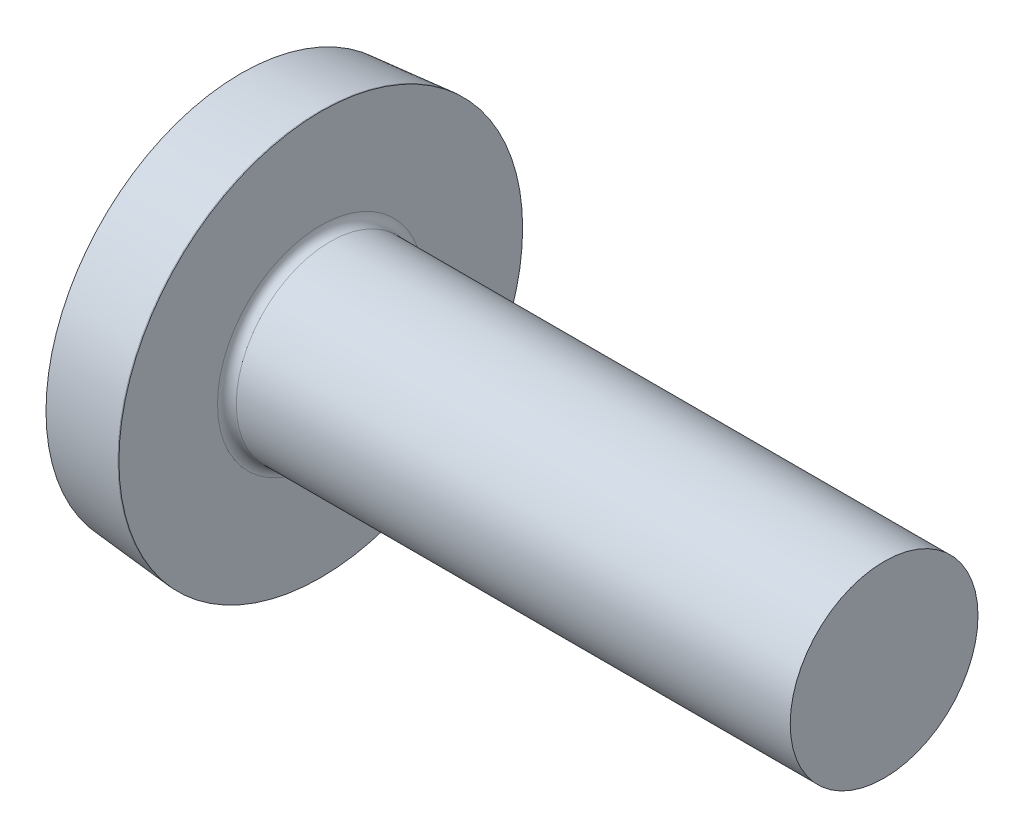
ISO-10303-21;
HEADER;
FILE_DESCRIPTION(('STEP AP214'),'2;1');
FILE_NAME('part.step','',(''),(''),'','','');
FILE_SCHEMA(('AUTOMOTIVE_DESIGN { 1 0 10303 214 1 1 1 1 }'));
ENDSEC;
DATA;
#1=APPLICATION_CONTEXT('core data for automotive mechanical design processes');
#2=APPLICATION_PROTOCOL_DEFINITION('international standard','automotive_design',2000,#1);
#3=PRODUCT_CONTEXT('',#1,'mechanical');
#4=PRODUCT('Part','Part','',(#3));
#5=PRODUCT_RELATED_PRODUCT_CATEGORY('part','',(#4));
#6=PRODUCT_DEFINITION_FORMATION('','',#4);
#7=PRODUCT_DEFINITION_CONTEXT('part definition',#1,'design');
#8=PRODUCT_DEFINITION('design','',#6,#7);
#9=PRODUCT_DEFINITION_SHAPE('','',#8);
#10=(LENGTH_UNIT() NAMED_UNIT(*) SI_UNIT(.MILLI.,.METRE.));
#11=(NAMED_UNIT(*) PLANE_ANGLE_UNIT() SI_UNIT($,.RADIAN.));
#12=(NAMED_UNIT(*) SI_UNIT($,.STERADIAN.) SOLID_ANGLE_UNIT());
#13=UNCERTAINTY_MEASURE_WITH_UNIT(LENGTH_MEASURE(1.E-05),#10,'distance_accuracy_value','');
#14=(GEOMETRIC_REPRESENTATION_CONTEXT(3) GLOBAL_UNCERTAINTY_ASSIGNED_CONTEXT((#13)) GLOBAL_UNIT_ASSIGNED_CONTEXT((#10,
#11,#12)) REPRESENTATION_CONTEXT('',''));
#15=CARTESIAN_POINT('',(0.,0.,0.));
#16=DIRECTION('',(0.,0.,1.));
#17=DIRECTION('',(1.,0.,0.));
#18=AXIS2_PLACEMENT_3D('',#15,#16,#17);
#19=CARTESIAN_POINT('',(6.3348454251532,0.,0.));
#20=DIRECTION('',(-1.,0.,0.));
#21=DIRECTION('',(0.,1.,0.));
#22=AXIS2_PLACEMENT_3D('',#19,#20,#21);
#23=SPHERICAL_SURFACE('',#22,6.3348454251532);
#24=CARTESIAN_POINT('',(0.35,0.,0.));
#25=DIRECTION('',(-1.,0.,0.));
#26=DIRECTION('',(0.,0.,1.));
#27=AXIS2_PLACEMENT_3D('',#24,#25,#26);
#28=CIRCLE('',#27,2.07650952263822);
#29=CARTESIAN_POINT('',(0.35,0.,2.07650952263822));
#30=VERTEX_POINT('',#29);
#31=EDGE_CURVE('E213',#30,#30,#28,.T.);
#32=ORIENTED_EDGE('',*,*,#31,.T.);
#33=EDGE_LOOP('',(#32));
#34=FACE_BOUND('',#33,.T.);
#35=CARTESIAN_POINT('',(0.0308541818001143,0.,0.));
#36=DIRECTION('',(1.,0.,0.));
#37=DIRECTION('',(0.,0.,-1.));
#38=AXIS2_PLACEMENT_3D('',#35,#36,#37);
#39=CIRCLE('',#38,0.624468545494531);
#40=CARTESIAN_POINT('',(0.0308541818001147,-0.369999999999998,-0.503051651733752));
#41=VERTEX_POINT('',#40);
#42=CARTESIAN_POINT('',(0.0308541818001148,-0.503051651733748,-0.37));
#43=VERTEX_POINT('',#42);
#44=EDGE_CURVE('E339',#41,#43,#39,.F.);
#45=ORIENTED_EDGE('',*,*,#44,.F.);
#46=CARTESIAN_POINT('',(6.3348454251532,-0.370000000000002,0.));
#47=DIRECTION('',(0.,1.,0.));
#48=DIRECTION('',(0.,0.,1.));
#49=AXIS2_PLACEMENT_3D('',#46,#47,#48);
#50=CIRCLE('',#49,6.32403087916121);
#51=CARTESIAN_POINT('',(0.0987223988869555,-0.369999999999996,-1.05077883584338));
#52=VERTEX_POINT('',#51);
#53=EDGE_CURVE('E273',#52,#41,#50,.T.);
#54=ORIENTED_EDGE('',*,*,#53,.F.);
#55=CARTESIAN_POINT('',(5.51287510984501,0.,1.64861767760881));
#56=DIRECTION('',(0.446197753347436,0.,-0.894934391398443));
#57=DIRECTION('',(-0.894934391398442,0.,-0.446197753347436));
#58=AXIS2_PLACEMENT_3D('',#55,#56,#57);
#59=CIRCLE('',#58,6.06108002870877);
#60=CARTESIAN_POINT('',(0.0987223988869555,0.370000000000004,-1.05077883584338));
#61=VERTEX_POINT('',#60);
#62=EDGE_CURVE('E247',#52,#61,#59,.T.);
#63=ORIENTED_EDGE('',*,*,#62,.T.);
#64=CARTESIAN_POINT('',(6.3348454251532,0.37,0.));
#65=DIRECTION('',(0.,-1.,0.));
#66=DIRECTION('',(0.,0.,-1.));
#67=AXIS2_PLACEMENT_3D('',#64,#65,#66);
#68=CIRCLE('',#67,6.32403087916121);
#69=CARTESIAN_POINT('',(0.0308541818001145,0.370000000000002,-0.503051651733749));
#70=VERTEX_POINT('',#69);
#71=EDGE_CURVE('E301',#70,#61,#68,.T.);
#72=ORIENTED_EDGE('',*,*,#71,.F.);
#73=CARTESIAN_POINT('',(0.0308541818001148,0.50305165173374,-0.37));
#74=VERTEX_POINT('',#73);
#75=EDGE_CURVE('E354',#74,#70,#39,.F.);
#76=ORIENTED_EDGE('',*,*,#75,.F.);
#77=CARTESIAN_POINT('',(6.3348454251532,0.,-0.37));
#78=DIRECTION('',(0.,0.,1.));
#79=DIRECTION('',(0.,-1.,0.));
#80=AXIS2_PLACEMENT_3D('',#77,#78,#79);
#81=CIRCLE('',#80,6.32403087916121);
#82=CARTESIAN_POINT('',(0.0987223988869555,1.05077883584338,-0.37));
#83=VERTEX_POINT('',#82);
#84=EDGE_CURVE('E241',#83,#74,#81,.T.);
#85=ORIENTED_EDGE('',*,*,#84,.F.);
#86=CARTESIAN_POINT('',(5.51287510984501,-1.64861767760882,0.));
#87=DIRECTION('',(0.446197753347436,0.894934391398442,0.));
#88=DIRECTION('',(-0.894934391398442,0.446197753347436,0.));
#89=AXIS2_PLACEMENT_3D('',#86,#87,#88);
#90=CIRCLE('',#89,6.06108002870877);
#91=CARTESIAN_POINT('',(0.0987223988869555,1.05077883584338,0.37));
#92=VERTEX_POINT('',#91);
#93=EDGE_CURVE('E244',#83,#92,#90,.T.);
#94=ORIENTED_EDGE('',*,*,#93,.T.);
#95=CARTESIAN_POINT('',(6.3348454251532,0.,0.370000000000002));
#96=DIRECTION('',(0.,0.,-1.));
#97=DIRECTION('',(-1.,0.,0.));
#98=AXIS2_PLACEMENT_3D('',#95,#96,#97);
#99=CIRCLE('',#98,6.32403087916121);
#100=CARTESIAN_POINT('',(0.0308541818001143,0.503051651733743,0.369999999999999));
#101=VERTEX_POINT('',#100);
#102=EDGE_CURVE('E237',#101,#92,#99,.T.);
#103=ORIENTED_EDGE('',*,*,#102,.F.);
#104=CARTESIAN_POINT('',(0.0308541818001154,0.369999999999998,0.503051651733752));
#105=VERTEX_POINT('',#104);
#106=EDGE_CURVE('E353',#105,#101,#39,.F.);
#107=ORIENTED_EDGE('',*,*,#106,.F.);
#108=CARTESIAN_POINT('',(0.0987223988869546,0.369999999999996,1.05077883584338));
#109=VERTEX_POINT('',#108);
#110=EDGE_CURVE('E257',#109,#105,#68,.T.);
#111=ORIENTED_EDGE('',*,*,#110,.F.);
#112=CARTESIAN_POINT('',(5.51287510984501,0.,-1.64861767760882));
#113=DIRECTION('',(0.446197753347436,0.,0.894934391398442));
#114=DIRECTION('',(0.894934391398442,0.,-0.446197753347436));
#115=AXIS2_PLACEMENT_3D('',#112,#113,#114);
#116=CIRCLE('',#115,6.06108002870877);
#117=CARTESIAN_POINT('',(0.0987223988869546,-0.370000000000004,1.05077883584338));
#118=VERTEX_POINT('',#117);
#119=EDGE_CURVE('E48',#109,#118,#116,.T.);
#120=ORIENTED_EDGE('',*,*,#119,.T.);
#121=CARTESIAN_POINT('',(0.0308541818001156,-0.370000000000001,0.50305165173375));
#122=VERTEX_POINT('',#121);
#123=EDGE_CURVE('E254',#122,#118,#50,.T.);
#124=ORIENTED_EDGE('',*,*,#123,.F.);
#125=CARTESIAN_POINT('',(0.0308541818001143,-0.503051651733752,0.369999999999999));
#126=VERTEX_POINT('',#125);
#127=EDGE_CURVE('E385',#126,#122,#39,.F.);
#128=ORIENTED_EDGE('',*,*,#127,.F.);
#129=CARTESIAN_POINT('',(0.0987223988869555,-1.05077883584338,0.369999999999999));
#130=VERTEX_POINT('',#129);
#131=EDGE_CURVE('E238',#130,#126,#99,.T.);
#132=ORIENTED_EDGE('',*,*,#131,.F.);
#133=CARTESIAN_POINT('',(5.51287510984501,1.64861767760881,0.));
#134=DIRECTION('',(0.446197753347436,-0.894934391398443,0.));
#135=DIRECTION('',(0.894934391398442,0.446197753347436,0.));
#136=AXIS2_PLACEMENT_3D('',#133,#134,#135);
#137=CIRCLE('',#136,6.06108002870877);
#138=CARTESIAN_POINT('',(0.0987223988869555,-1.05077883584338,-0.37));
#139=VERTEX_POINT('',#138);
#140=EDGE_CURVE('E234',#130,#139,#137,.T.);
#141=ORIENTED_EDGE('',*,*,#140,.T.);
#142=EDGE_CURVE('E63',#43,#139,#81,.T.);
#143=ORIENTED_EDGE('',*,*,#142,.F.);
#144=EDGE_LOOP('',(#45,#54,#63,#72,#76,#85,#94,#103,#107,#111,#120,#124,#128,#132,#141,#143));
#145=FACE_BOUND('',#144,.T.);
#146=ADVANCED_FACE('F35',(#34,#145),#23,.T.);
#147=CARTESIAN_POINT('',(1.01,0.596432660078354,-0.37));
#148=DIRECTION('',(0.,0.,1.));
#149=DIRECTION('',(0.,-1.,0.));
#150=AXIS2_PLACEMENT_3D('',#147,#148,#149);
#151=PLANE('',#150);
#152=ORIENTED_EDGE('',*,*,#84,.T.);
#153=CARTESIAN_POINT('',(-1.00375424089343,0.59046737533365,-0.37));
#154=CARTESIAN_POINT('',(-0.812310935860284,0.574661113876544,-0.37));
#155=CARTESIAN_POINT('',(-0.620880739529457,0.558692671237369,-0.37));
#156=CARTESIAN_POINT('',(-0.238044908616173,0.526292999478973,-0.37));
#157=CARTESIAN_POINT('',(-0.0466392770084405,0.50986173526022,-0.37));
#158=CARTESIAN_POINT('',(0.336119298740636,0.476400416240064,-0.37));
#159=CARTESIAN_POINT('',(0.52747224306179,0.459370363508376,-0.37));
#160=CARTESIAN_POINT('',(0.814438066922587,0.433198294596456,-0.37));
#161=CARTESIAN_POINT('',(0.910079559074602,0.424370077730999,-0.37));
#162=CARTESIAN_POINT('',(1.10134094999858,0.406460000314888,-0.37));
#163=CARTESIAN_POINT('',(1.19696084824844,0.397378134180927,-0.37));
#164=CARTESIAN_POINT('',(1.45340398862988,0.372604820081678,-0.37));
#165=CARTESIAN_POINT('',(1.61420013682287,0.356631661992527,-0.37));
#166=CARTESIAN_POINT('',(1.93565257091465,0.323419643215244,-0.37));
#167=CARTESIAN_POINT('',(2.09630886589015,0.306180872007446,-0.37));
#168=CARTESIAN_POINT('',(2.33714482323072,0.278751725007018,-0.37));
#169=CARTESIAN_POINT('',(2.41741328301872,0.269344994364363,-0.37));
#170=CARTESIAN_POINT('',(2.57785878610541,0.249811311041056,-0.37));
#171=CARTESIAN_POINT('',(2.65803583391149,0.239684395583776,-0.37));
#172=CARTESIAN_POINT('',(2.8182787310521,0.218399805516524,-0.37));
#173=CARTESIAN_POINT('',(2.89834454264389,0.207241840980378,-0.37));
#174=CARTESIAN_POINT('',(3.01826768351679,0.189275113325608,-0.37));
#175=CARTESIAN_POINT('',(3.05821623214618,0.183080654485872,-0.37));
#176=CARTESIAN_POINT('',(3.13802273653468,0.17011763897259,-0.37));
#177=CARTESIAN_POINT('',(3.17788068529328,0.16334903938742,-0.37));
#178=CARTESIAN_POINT('',(3.21767546600845,0.156211627647228,-0.37));
#179=B_SPLINE_CURVE_WITH_KNOTS('',3,(#153,#154,#155,#156,#157,#158,#159,#160,#161,#162,#163,
#164,#165,#166,#167,#168,#169,#170,#171,#172,#173,#174,#175,#176,#177,#178),.UNSPECIFIED.,.F.,
.F.,(4,2,2,2,2,2,2,2,2,2,2,2,4),(0.,0.576284452128467,1.15261272690249,1.72893900979114,
2.01708296211952,2.3052332620563,2.78999332133071,3.27471914044355,3.51717007338411,
3.75960848413396,4.00211527609772,4.123389551722,4.24467289945864),.UNSPECIFIED.);
#180=CARTESIAN_POINT('',(1.01,0.415013252800438,-0.369999999999999));
#181=VERTEX_POINT('',#180);
#182=EDGE_CURVE('E374',#74,#181,#179,.T.);
#183=ORIENTED_EDGE('',*,*,#182,.T.);
#184=DIRECTION('',(0.,1.,0.));
#185=VECTOR('',#184,1.);
#186=CARTESIAN_POINT('',(1.01,-0.596432660078355,-0.37));
#187=LINE('',#186,#185);
#188=CARTESIAN_POINT('',(1.01,0.596432660078354,-0.37));
#189=VERTEX_POINT('',#188);
#190=EDGE_CURVE('E322',#181,#189,#187,.T.);
#191=ORIENTED_EDGE('',*,*,#190,.T.);
#192=DIRECTION('',(0.894934391398442,-0.446197753347436,0.));
#193=VECTOR('',#192,1.);
#194=CARTESIAN_POINT('',(0.,1.1,-0.37));
#195=LINE('',#194,#193);
#196=EDGE_CURVE('E214',#83,#189,#195,.T.);
#197=ORIENTED_EDGE('',*,*,#196,.F.);
#198=EDGE_LOOP('',(#152,#183,#191,#197));
#199=FACE_BOUND('',#198,.T.);
#200=ADVANCED_FACE('F169',(#199),#151,.T.);
#201=CARTESIAN_POINT('',(1.01,-0.596432660078355,-0.37));
#202=VERTEX_POINT('',#201);
#203=CARTESIAN_POINT('',(1.01,-0.415013252800438,-0.369999999999999));
#204=VERTEX_POINT('',#203);
#205=EDGE_CURVE('E222',#202,#204,#187,.T.);
#206=ORIENTED_EDGE('',*,*,#205,.T.);
#207=CARTESIAN_POINT('',(-1.00375424089343,-0.59046737533365,-0.37));
#208=CARTESIAN_POINT('',(-0.812310935860285,-0.574661113876544,-0.37));
#209=CARTESIAN_POINT('',(-0.620880739529458,-0.558692671237369,-0.37));
#210=CARTESIAN_POINT('',(-0.238044908616174,-0.526292999478973,-0.37));
#211=CARTESIAN_POINT('',(-0.0466392770084411,-0.50986173526022,-0.37));
#212=CARTESIAN_POINT('',(0.336119298740635,-0.476400416240064,-0.37));
#213=CARTESIAN_POINT('',(0.527472243061789,-0.459370363508376,-0.37));
#214=CARTESIAN_POINT('',(0.814438066922586,-0.433198294596456,-0.37));
#215=CARTESIAN_POINT('',(0.910079559074601,-0.424370077730999,-0.37));
#216=CARTESIAN_POINT('',(1.10134094999858,-0.406460000314888,-0.37));
#217=CARTESIAN_POINT('',(1.19696084824844,-0.397378134180927,-0.37));
#218=CARTESIAN_POINT('',(1.45340398862988,-0.372604820081678,-0.37));
#219=CARTESIAN_POINT('',(1.61420013682287,-0.356631661992527,-0.37));
#220=CARTESIAN_POINT('',(1.93565257091465,-0.323419643215243,-0.37));
#221=CARTESIAN_POINT('',(2.09630886589015,-0.306180872007446,-0.37));
#222=CARTESIAN_POINT('',(2.33714482323072,-0.278751725007017,-0.37));
#223=CARTESIAN_POINT('',(2.41741328301872,-0.269344994364363,-0.37));
#224=CARTESIAN_POINT('',(2.57785878610541,-0.249811311041056,-0.37));
#225=CARTESIAN_POINT('',(2.6580358339115,-0.239684395583775,-0.37));
#226=CARTESIAN_POINT('',(2.81827873105211,-0.218399805516523,-0.37));
#227=CARTESIAN_POINT('',(2.8983445426439,-0.207241840980377,-0.37));
#228=CARTESIAN_POINT('',(3.01826768351679,-0.189275113325608,-0.37));
#229=CARTESIAN_POINT('',(3.05821623214619,-0.183080654485871,-0.37));
#230=CARTESIAN_POINT('',(3.13802273653468,-0.170117638972589,-0.37));
#231=CARTESIAN_POINT('',(3.17788068529328,-0.16334903938742,-0.37));
#232=CARTESIAN_POINT('',(3.21767546600845,-0.156211627647227,-0.37));
#233=B_SPLINE_CURVE_WITH_KNOTS('',3,(#207,#208,#209,#210,#211,#212,#213,#214,#215,#216,#217,
#218,#219,#220,#221,#222,#223,#224,#225,#226,#227,#228,#229,#230,#231,#232),.UNSPECIFIED.,.F.,
.F.,(4,2,2,2,2,2,2,2,2,2,2,2,4),(0.,0.576284452128467,1.15261272690249,1.72893900979114,
2.01708296211952,2.3052332620563,2.78999332133071,3.27471914044355,3.51717007338411,
3.75960848413396,4.00211527609772,4.123389551722,4.24467289945864),.UNSPECIFIED.);
#234=EDGE_CURVE('E352',#204,#43,#233,.F.);
#235=ORIENTED_EDGE('',*,*,#234,.T.);
#236=ORIENTED_EDGE('',*,*,#142,.T.);
#237=DIRECTION('',(0.894934391398442,0.446197753347436,0.));
#238=VECTOR('',#237,1.);
#239=CARTESIAN_POINT('',(0.,-1.1,-0.37));
#240=LINE('',#239,#238);
#241=EDGE_CURVE('E304',#139,#202,#240,.T.);
#242=ORIENTED_EDGE('',*,*,#241,.T.);
#243=EDGE_LOOP('',(#206,#235,#236,#242));
#244=FACE_BOUND('',#243,.T.);
#245=ADVANCED_FACE('F175',(#244),#151,.T.);
#246=CARTESIAN_POINT('',(1.01,-0.596432660078355,0.37));
#247=DIRECTION('',(0.,0.,-1.));
#248=DIRECTION('',(-1.,0.,0.));
#249=AXIS2_PLACEMENT_3D('',#246,#247,#248);
#250=PLANE('',#249);
#251=DIRECTION('',(0.,-1.,0.));
#252=VECTOR('',#251,1.);
#253=CARTESIAN_POINT('',(1.01,0.596432660078354,0.37));
#254=LINE('',#253,#252);
#255=CARTESIAN_POINT('',(1.01,0.596432660078354,0.37));
#256=VERTEX_POINT('',#255);
#257=CARTESIAN_POINT('',(1.01,0.415013252800438,0.369999999999999));
#258=VERTEX_POINT('',#257);
#259=EDGE_CURVE('E312',#256,#258,#254,.T.);
#260=ORIENTED_EDGE('',*,*,#259,.T.);
#261=CARTESIAN_POINT('',(-1.00375424089236,0.590467375333562,0.369999999999999));
#262=CARTESIAN_POINT('',(-0.81231093585923,0.574661113876457,0.369999999999999));
#263=CARTESIAN_POINT('',(-0.620880739528422,0.558692671237283,0.369999999999999));
#264=CARTESIAN_POINT('',(-0.238044908615175,0.526292999478888,0.369999999999999));
#265=CARTESIAN_POINT('',(-0.0466392770074608,0.509861735260135,0.37));
#266=CARTESIAN_POINT('',(0.336119298741582,0.47640041623998,0.37));
#267=CARTESIAN_POINT('',(0.527472243062721,0.459370363508292,0.37));
#268=CARTESIAN_POINT('',(0.814438066923495,0.433198294596373,0.37));
#269=CARTESIAN_POINT('',(0.910079559075503,0.424370077730915,0.37));
#270=CARTESIAN_POINT('',(1.10134094999946,0.406460000314804,0.37));
#271=CARTESIAN_POINT('',(1.19696084824931,0.397378134180843,0.37));
#272=CARTESIAN_POINT('',(1.45340398863075,0.372604820081592,0.37));
#273=CARTESIAN_POINT('',(1.61420013682374,0.356631661992439,0.37));
#274=CARTESIAN_POINT('',(1.93565257091552,0.323419643215151,0.37));
#275=CARTESIAN_POINT('',(2.09630886589102,0.306180872007351,0.37));
#276=CARTESIAN_POINT('',(2.33714482323159,0.278751725006916,0.37));
#277=CARTESIAN_POINT('',(2.41741328301959,0.269344994364259,0.37));
#278=CARTESIAN_POINT('',(2.57785878610628,0.249811311040946,0.37));
#279=CARTESIAN_POINT('',(2.65803583391236,0.239684395583663,0.370000000000001));
#280=CARTESIAN_POINT('',(2.81827873105297,0.218399805516403,0.370000000000001));
#281=CARTESIAN_POINT('',(2.89834454264476,0.207241840980253,0.370000000000001));
#282=CARTESIAN_POINT('',(3.01826768351766,0.189275113325474,0.370000000000001));
#283=CARTESIAN_POINT('',(3.05821623214705,0.183080654485734,0.370000000000001));
#284=CARTESIAN_POINT('',(3.13802273653554,0.170117638972443,0.370000000000001));
#285=CARTESIAN_POINT('',(3.17788068529415,0.163349039387269,0.370000000000001));
#286=CARTESIAN_POINT('',(3.21767546600931,0.15621162764707,0.370000000000001));
#287=B_SPLINE_CURVE_WITH_KNOTS('',3,(#261,#262,#263,#264,#265,#266,#267,#268,#269,#270,#271,
#272,#273,#274,#275,#276,#277,#278,#279,#280,#281,#282,#283,#284,#285,#286),.UNSPECIFIED.,.F.,
.F.,(4,2,2,2,2,2,2,2,2,2,2,2,4),(0.,0.576284452128412,1.15261272690238,1.72893900979099,
2.01708296211935,2.3052332620561,2.78999332133051,3.27471914044335,3.51717007338391,
3.75960848413376,4.00211527609752,4.1233895517218,4.24467289945844),.UNSPECIFIED.);
#288=EDGE_CURVE('E278',#258,#101,#287,.F.);
#289=ORIENTED_EDGE('',*,*,#288,.T.);
#290=ORIENTED_EDGE('',*,*,#102,.T.);
#291=DIRECTION('',(0.894934391398442,-0.446197753347436,0.));
#292=VECTOR('',#291,1.);
#293=CARTESIAN_POINT('',(0.,1.1,0.37));
#294=LINE('',#293,#292);
#295=EDGE_CURVE('E219',#92,#256,#294,.T.);
#296=ORIENTED_EDGE('',*,*,#295,.T.);
#297=EDGE_LOOP('',(#260,#289,#290,#296));
#298=FACE_BOUND('',#297,.T.);
#299=ADVANCED_FACE('F370',(#298),#250,.T.);
#300=ORIENTED_EDGE('',*,*,#131,.T.);
#301=CARTESIAN_POINT('',(-1.00375424089236,-0.590467375333562,0.369999999999999));
#302=CARTESIAN_POINT('',(-0.81231093585923,-0.574661113876457,0.369999999999999));
#303=CARTESIAN_POINT('',(-0.620880739528422,-0.558692671237283,0.369999999999999));
#304=CARTESIAN_POINT('',(-0.238044908615175,-0.526292999478888,0.369999999999999));
#305=CARTESIAN_POINT('',(-0.0466392770074607,-0.509861735260136,0.369999999999999));
#306=CARTESIAN_POINT('',(0.336119298741582,-0.47640041623998,0.37));
#307=CARTESIAN_POINT('',(0.52747224306272,-0.459370363508292,0.37));
#308=CARTESIAN_POINT('',(0.814438066923495,-0.433198294596373,0.37));
#309=CARTESIAN_POINT('',(0.910079559075503,-0.424370077730915,0.37));
#310=CARTESIAN_POINT('',(1.10134094999946,-0.406460000314804,0.37));
#311=CARTESIAN_POINT('',(1.19696084824931,-0.397378134180843,0.37));
#312=CARTESIAN_POINT('',(1.45340398863075,-0.372604820081592,0.37));
#313=CARTESIAN_POINT('',(1.61420013682374,-0.356631661992439,0.37));
#314=CARTESIAN_POINT('',(1.93565257091552,-0.323419643215151,0.37));
#315=CARTESIAN_POINT('',(2.09630886589102,-0.306180872007351,0.37));
#316=CARTESIAN_POINT('',(2.33714482323159,-0.278751725006916,0.37));
#317=CARTESIAN_POINT('',(2.41741328301959,-0.269344994364259,0.37));
#318=CARTESIAN_POINT('',(2.57785878610628,-0.249811311040947,0.37));
#319=CARTESIAN_POINT('',(2.65803583391236,-0.239684395583663,0.370000000000001));
#320=CARTESIAN_POINT('',(2.81827873105297,-0.218399805516403,0.370000000000001));
#321=CARTESIAN_POINT('',(2.89834454264476,-0.207241840980253,0.370000000000001));
#322=CARTESIAN_POINT('',(3.01826768351765,-0.189275113325474,0.370000000000001));
#323=CARTESIAN_POINT('',(3.05821623214705,-0.183080654485734,0.370000000000001));
#324=CARTESIAN_POINT('',(3.13802273653554,-0.170117638972444,0.370000000000001));
#325=CARTESIAN_POINT('',(3.17788068529414,-0.163349039387269,0.370000000000001));
#326=CARTESIAN_POINT('',(3.21767546600931,-0.15621162764707,0.370000000000001));
#327=B_SPLINE_CURVE_WITH_KNOTS('',3,(#301,#302,#303,#304,#305,#306,#307,#308,#309,#310,#311,
#312,#313,#314,#315,#316,#317,#318,#319,#320,#321,#322,#323,#324,#325,#326),.UNSPECIFIED.,.F.,
.F.,(4,2,2,2,2,2,2,2,2,2,2,2,4),(0.,0.576284452128412,1.15261272690238,1.72893900979099,
2.01708296211935,2.3052332620561,2.78999332133051,3.27471914044335,3.51717007338391,
3.75960848413376,4.00211527609752,4.1233895517218,4.24467289945844),.UNSPECIFIED.);
#328=CARTESIAN_POINT('',(1.01,-0.415013252800438,0.369999999999999));
#329=VERTEX_POINT('',#328);
#330=EDGE_CURVE('E386',#126,#329,#327,.T.);
#331=ORIENTED_EDGE('',*,*,#330,.T.);
#332=CARTESIAN_POINT('',(1.01,-0.596432660078355,0.37));
#333=VERTEX_POINT('',#332);
#334=EDGE_CURVE('E314',#329,#333,#254,.T.);
#335=ORIENTED_EDGE('',*,*,#334,.T.);
#336=DIRECTION('',(0.894934391398442,0.446197753347436,0.));
#337=VECTOR('',#336,1.);
#338=CARTESIAN_POINT('',(0.,-1.1,0.369999999999999));
#339=LINE('',#338,#337);
#340=EDGE_CURVE('E306',#130,#333,#339,.T.);
#341=ORIENTED_EDGE('',*,*,#340,.F.);
#342=EDGE_LOOP('',(#300,#331,#335,#341));
#343=FACE_BOUND('',#342,.T.);
#344=ADVANCED_FACE('F415',(#343),#250,.T.);
#345=CARTESIAN_POINT('',(1.01,0.596432660078354,-0.37));
#346=DIRECTION('',(-1.,0.,0.));
#347=DIRECTION('',(0.,0.,1.));
#348=AXIS2_PLACEMENT_3D('',#345,#346,#347);
#349=PLANE('',#348);
#350=ORIENTED_EDGE('',*,*,#334,.F.);
#351=CARTESIAN_POINT('',(1.01,0.,0.));
#352=DIRECTION('',(-1.,0.,0.));
#353=DIRECTION('',(0.,0.,1.));
#354=AXIS2_PLACEMENT_3D('',#351,#352,#353);
#355=CIRCLE('',#354,0.556);
#356=EDGE_CURVE('E347',#204,#329,#355,.T.);
#357=ORIENTED_EDGE('',*,*,#356,.F.);
#358=ORIENTED_EDGE('',*,*,#205,.F.);
#359=DIRECTION('',(0.,0.,1.));
#360=VECTOR('',#359,1.);
#361=CARTESIAN_POINT('',(1.01,-0.596432660078355,-0.37));
#362=LINE('',#361,#360);
#363=EDGE_CURVE('E309',#202,#333,#362,.T.);
#364=ORIENTED_EDGE('',*,*,#363,.T.);
#365=EDGE_LOOP('',(#350,#357,#358,#364));
#366=FACE_BOUND('',#365,.T.);
#367=ADVANCED_FACE('F408',(#366),#349,.T.);
#368=DIRECTION('',(0.,0.,-1.));
#369=VECTOR('',#368,1.);
#370=CARTESIAN_POINT('',(1.01,-0.370000000000002,0.596432660078353));
#371=LINE('',#370,#369);
#372=CARTESIAN_POINT('',(1.01,-0.369999999999998,-0.415013252800441));
#373=VERTEX_POINT('',#372);
#374=CARTESIAN_POINT('',(1.01,-0.369999999999998,-0.596432660078356));
#375=VERTEX_POINT('',#374);
#376=EDGE_CURVE('E295',#373,#375,#371,.T.);
#377=ORIENTED_EDGE('',*,*,#376,.F.);
#378=CARTESIAN_POINT('',(1.01,0.370000000000001,-0.415013252800436));
#379=VERTEX_POINT('',#378);
#380=EDGE_CURVE('E55',#379,#373,#355,.T.);
#381=ORIENTED_EDGE('',*,*,#380,.F.);
#382=DIRECTION('',(0.,0.,1.));
#383=VECTOR('',#382,1.);
#384=CARTESIAN_POINT('',(1.01,0.370000000000002,-0.596432660078354));
#385=LINE('',#384,#383);
#386=CARTESIAN_POINT('',(1.01,0.370000000000002,-0.596432660078354));
#387=VERTEX_POINT('',#386);
#388=EDGE_CURVE('E298',#387,#379,#385,.T.);
#389=ORIENTED_EDGE('',*,*,#388,.F.);
#390=DIRECTION('',(0.,-1.,0.));
#391=VECTOR('',#390,1.);
#392=CARTESIAN_POINT('',(1.01,0.370000000000002,-0.596432660078354));
#393=LINE('',#392,#391);
#394=EDGE_CURVE('E289',#387,#375,#393,.T.);
#395=ORIENTED_EDGE('',*,*,#394,.T.);
#396=EDGE_LOOP('',(#377,#381,#389,#395));
#397=FACE_BOUND('',#396,.T.);
#398=ADVANCED_FACE('F342',(#397),#349,.T.);
#399=ORIENTED_EDGE('',*,*,#190,.F.);
#400=EDGE_CURVE('E346',#258,#181,#355,.T.);
#401=ORIENTED_EDGE('',*,*,#400,.F.);
#402=ORIENTED_EDGE('',*,*,#259,.F.);
#403=DIRECTION('',(0.,0.,-1.));
#404=VECTOR('',#403,1.);
#405=CARTESIAN_POINT('',(1.01,0.596432660078354,0.37));
#406=LINE('',#405,#404);
#407=EDGE_CURVE('E315',#256,#189,#406,.T.);
#408=ORIENTED_EDGE('',*,*,#407,.T.);
#409=EDGE_LOOP('',(#399,#401,#402,#408));
#410=FACE_BOUND('',#409,.T.);
#411=ADVANCED_FACE('F409',(#410),#349,.T.);
#412=CARTESIAN_POINT('',(1.01,0.369999999999998,0.596432660078356));
#413=DIRECTION('',(0.,-1.,0.));
#414=DIRECTION('',(0.,0.,-1.));
#415=AXIS2_PLACEMENT_3D('',#412,#413,#414);
#416=PLANE('',#415);
#417=ORIENTED_EDGE('',*,*,#110,.T.);
#418=CARTESIAN_POINT('',(-1.00375424089343,0.369999999999998,0.590467375333651));
#419=CARTESIAN_POINT('',(-0.812310935860284,0.369999999999998,0.574661113876545));
#420=CARTESIAN_POINT('',(-0.620880739529457,0.369999999999998,0.558692671237371));
#421=CARTESIAN_POINT('',(-0.238044908616173,0.369999999999998,0.526292999478974));
#422=CARTESIAN_POINT('',(-0.0466392770084403,0.369999999999998,0.509861735260221));
#423=CARTESIAN_POINT('',(0.336119298740636,0.369999999999998,0.476400416240065));
#424=CARTESIAN_POINT('',(0.52747224306179,0.369999999999998,0.459370363508377));
#425=CARTESIAN_POINT('',(0.814438066922587,0.369999999999998,0.433198294596458));
#426=CARTESIAN_POINT('',(0.910079559074602,0.369999999999998,0.424370077731));
#427=CARTESIAN_POINT('',(1.10134094999858,0.369999999999999,0.406460000314889));
#428=CARTESIAN_POINT('',(1.19696084824844,0.369999999999999,0.397378134180928));
#429=CARTESIAN_POINT('',(1.45340398862988,0.369999999999999,0.372604820081679));
#430=CARTESIAN_POINT('',(1.61420013682287,0.369999999999999,0.356631661992528));
#431=CARTESIAN_POINT('',(1.93565257091465,0.369999999999999,0.323419643215245));
#432=CARTESIAN_POINT('',(2.09630886589015,0.369999999999999,0.306180872007448));
#433=CARTESIAN_POINT('',(2.33714482323072,0.369999999999999,0.278751725007019));
#434=CARTESIAN_POINT('',(2.41741328301872,0.369999999999999,0.269344994364365));
#435=CARTESIAN_POINT('',(2.57785878610541,0.369999999999999,0.249811311041057));
#436=CARTESIAN_POINT('',(2.65803583391149,0.369999999999999,0.239684395583777));
#437=CARTESIAN_POINT('',(2.8182787310521,0.369999999999999,0.218399805516525));
#438=CARTESIAN_POINT('',(2.8983445426439,0.369999999999999,0.207241840980379));
#439=CARTESIAN_POINT('',(3.01826768351679,0.369999999999999,0.189275113325609));
#440=CARTESIAN_POINT('',(3.05821623214618,0.369999999999999,0.183080654485873));
#441=CARTESIAN_POINT('',(3.13802273653468,0.369999999999999,0.170117638972591));
#442=CARTESIAN_POINT('',(3.17788068529328,0.369999999999999,0.163349039387421));
#443=CARTESIAN_POINT('',(3.21767546600845,0.369999999999999,0.156211627647229));
#444=B_SPLINE_CURVE_WITH_KNOTS('',3,(#418,#419,#420,#421,#422,#423,#424,#425,#426,#427,#428,
#429,#430,#431,#432,#433,#434,#435,#436,#437,#438,#439,#440,#441,#442,#443),.UNSPECIFIED.,.F.,
.F.,(4,2,2,2,2,2,2,2,2,2,2,2,4),(0.,0.576284452128467,1.15261272690249,1.72893900979114,
2.01708296211952,2.3052332620563,2.78999332133071,3.27471914044355,3.51717007338411,
3.75960848413396,4.00211527609772,4.123389551722,4.24467289945864),.UNSPECIFIED.);
#445=CARTESIAN_POINT('',(1.01,0.369999999999998,0.415013252800439));
#446=VERTEX_POINT('',#445);
#447=EDGE_CURVE('E433',#105,#446,#444,.T.);
#448=ORIENTED_EDGE('',*,*,#447,.T.);
#449=CARTESIAN_POINT('',(1.01,0.369999999999998,0.596432660078356));
#450=VERTEX_POINT('',#449);
#451=EDGE_CURVE('E271',#446,#450,#385,.T.);
#452=ORIENTED_EDGE('',*,*,#451,.T.);
#453=DIRECTION('',(0.894934391398442,0.,-0.446197753347436));
#454=VECTOR('',#453,1.);
#455=CARTESIAN_POINT('',(0.,0.369999999999996,1.1));
#456=LINE('',#455,#454);
#457=EDGE_CURVE('E264',#109,#450,#456,.T.);
#458=ORIENTED_EDGE('',*,*,#457,.F.);
#459=EDGE_LOOP('',(#417,#448,#452,#458));
#460=FACE_BOUND('',#459,.T.);
#461=ADVANCED_FACE('F268',(#460),#416,.T.);
#462=CARTESIAN_POINT('',(1.01,-0.369999999999998,-0.596432660078356));
#463=DIRECTION('',(0.,1.,0.));
#464=DIRECTION('',(-1.,0.,0.));
#465=AXIS2_PLACEMENT_3D('',#462,#463,#464);
#466=PLANE('',#465);
#467=CARTESIAN_POINT('',(1.01,-0.370000000000002,0.596432660078353));
#468=VERTEX_POINT('',#467);
#469=CARTESIAN_POINT('',(1.01,-0.370000000000001,0.415013252800436));
#470=VERTEX_POINT('',#469);
#471=EDGE_CURVE('E292',#468,#470,#371,.T.);
#472=ORIENTED_EDGE('',*,*,#471,.T.);
#473=CARTESIAN_POINT('',(-1.00375424089236,-0.370000000000001,0.590467375333561));
#474=CARTESIAN_POINT('',(-0.812310935859231,-0.370000000000001,0.574661113876455));
#475=CARTESIAN_POINT('',(-0.620880739528422,-0.370000000000001,0.558692671237282));
#476=CARTESIAN_POINT('',(-0.238044908615175,-0.370000000000001,0.526292999478887));
#477=CARTESIAN_POINT('',(-0.0466392770074609,-0.370000000000001,0.509861735260134));
#478=CARTESIAN_POINT('',(0.336119298741582,-0.370000000000001,0.476400416239979));
#479=CARTESIAN_POINT('',(0.52747224306272,-0.370000000000001,0.459370363508291));
#480=CARTESIAN_POINT('',(0.814438066923495,-0.370000000000001,0.433198294596372));
#481=CARTESIAN_POINT('',(0.910079559075503,-0.370000000000001,0.424370077730914));
#482=CARTESIAN_POINT('',(1.10134094999946,-0.370000000000001,0.406460000314803));
#483=CARTESIAN_POINT('',(1.19696084824931,-0.370000000000001,0.397378134180842));
#484=CARTESIAN_POINT('',(1.45340398863075,-0.370000000000001,0.37260482008159));
#485=CARTESIAN_POINT('',(1.61420013682374,-0.370000000000001,0.356631661992437));
#486=CARTESIAN_POINT('',(1.93565257091552,-0.370000000000001,0.323419643215149));
#487=CARTESIAN_POINT('',(2.09630886589102,-0.370000000000001,0.306180872007349));
#488=CARTESIAN_POINT('',(2.33714482323159,-0.370000000000001,0.278751725006914));
#489=CARTESIAN_POINT('',(2.41741328301959,-0.370000000000001,0.269344994364258));
#490=CARTESIAN_POINT('',(2.57785878610628,-0.370000000000001,0.249811311040945));
#491=CARTESIAN_POINT('',(2.65803583391236,-0.370000000000001,0.239684395583662));
#492=CARTESIAN_POINT('',(2.81827873105297,-0.370000000000001,0.218399805516402));
#493=CARTESIAN_POINT('',(2.89834454264476,-0.370000000000001,0.207241840980251));
#494=CARTESIAN_POINT('',(3.01826768351765,-0.370000000000001,0.189275113325472));
#495=CARTESIAN_POINT('',(3.05821623214705,-0.370000000000001,0.183080654485732));
#496=CARTESIAN_POINT('',(3.13802273653554,-0.370000000000001,0.170117638972442));
#497=CARTESIAN_POINT('',(3.17788068529414,-0.370000000000001,0.163349039387268));
#498=CARTESIAN_POINT('',(3.21767546600931,-0.370000000000001,0.156211627647069));
#499=B_SPLINE_CURVE_WITH_KNOTS('',3,(#473,#474,#475,#476,#477,#478,#479,#480,#481,#482,#483,
#484,#485,#486,#487,#488,#489,#490,#491,#492,#493,#494,#495,#496,#497,#498),.UNSPECIFIED.,.F.,
.F.,(4,2,2,2,2,2,2,2,2,2,2,2,4),(0.,0.576284452128412,1.15261272690238,1.72893900979099,
2.01708296211935,2.3052332620561,2.78999332133051,3.27471914044335,3.51717007338391,
3.75960848413376,4.00211527609752,4.1233895517218,4.24467289945844),.UNSPECIFIED.);
#500=EDGE_CURVE('E379',#470,#122,#499,.F.);
#501=ORIENTED_EDGE('',*,*,#500,.T.);
#502=ORIENTED_EDGE('',*,*,#123,.T.);
#503=DIRECTION('',(0.894934391398442,0.,-0.446197753347436));
#504=VECTOR('',#503,1.);
#505=CARTESIAN_POINT('',(0.,-0.370000000000004,1.1));
#506=LINE('',#505,#504);
#507=EDGE_CURVE('E266',#118,#468,#506,.T.);
#508=ORIENTED_EDGE('',*,*,#507,.T.);
#509=EDGE_LOOP('',(#472,#501,#502,#508));
#510=FACE_BOUND('',#509,.T.);
#511=ADVANCED_FACE('F204',(#510),#466,.T.);
#512=ORIENTED_EDGE('',*,*,#388,.T.);
#513=CARTESIAN_POINT('',(-1.00375424089343,0.370000000000002,-0.590467375333649));
#514=CARTESIAN_POINT('',(-0.812310935860284,0.370000000000002,-0.574661113876542));
#515=CARTESIAN_POINT('',(-0.620880739529457,0.370000000000002,-0.558692671237368));
#516=CARTESIAN_POINT('',(-0.238044908616173,0.370000000000002,-0.526292999478972));
#517=CARTESIAN_POINT('',(-0.0466392770084405,0.370000000000002,-0.509861735260218));
#518=CARTESIAN_POINT('',(0.336119298740636,0.370000000000002,-0.476400416240062));
#519=CARTESIAN_POINT('',(0.527472243061789,0.370000000000002,-0.459370363508374));
#520=CARTESIAN_POINT('',(0.814438066922587,0.370000000000001,-0.433198294596455));
#521=CARTESIAN_POINT('',(0.910079559074602,0.370000000000001,-0.424370077730997));
#522=CARTESIAN_POINT('',(1.10134094999858,0.370000000000001,-0.406460000314887));
#523=CARTESIAN_POINT('',(1.19696084824844,0.370000000000001,-0.397378134180926));
#524=CARTESIAN_POINT('',(1.45340398862988,0.370000000000001,-0.372604820081676));
#525=CARTESIAN_POINT('',(1.61420013682287,0.370000000000001,-0.356631661992525));
#526=CARTESIAN_POINT('',(1.93565257091465,0.370000000000001,-0.323419643215242));
#527=CARTESIAN_POINT('',(2.09630886589015,0.370000000000001,-0.306180872007445));
#528=CARTESIAN_POINT('',(2.33714482323072,0.370000000000001,-0.278751725007016));
#529=CARTESIAN_POINT('',(2.41741328301872,0.370000000000001,-0.269344994364362));
#530=CARTESIAN_POINT('',(2.57785878610541,0.370000000000001,-0.249811311041055));
#531=CARTESIAN_POINT('',(2.65803583391149,0.370000000000001,-0.239684395583774));
#532=CARTESIAN_POINT('',(2.8182787310521,0.370000000000001,-0.218399805516522));
#533=CARTESIAN_POINT('',(2.8983445426439,0.370000000000001,-0.207241840980376));
#534=CARTESIAN_POINT('',(3.01826768351679,0.370000000000001,-0.189275113325607));
#535=CARTESIAN_POINT('',(3.05821623214618,0.370000000000001,-0.18308065448587));
#536=CARTESIAN_POINT('',(3.13802273653468,0.37,-0.170117638972589));
#537=CARTESIAN_POINT('',(3.17788068529328,0.37,-0.163349039387419));
#538=CARTESIAN_POINT('',(3.21767546600845,0.37,-0.156211627647226));
#539=B_SPLINE_CURVE_WITH_KNOTS('',3,(#513,#514,#515,#516,#517,#518,#519,#520,#521,#522,#523,
#524,#525,#526,#527,#528,#529,#530,#531,#532,#533,#534,#535,#536,#537,#538),.UNSPECIFIED.,.F.,
.F.,(4,2,2,2,2,2,2,2,2,2,2,2,4),(0.,0.576284452128467,1.15261272690249,1.72893900979114,
2.01708296211952,2.3052332620563,2.78999332133071,3.27471914044355,3.51717007338411,
3.75960848413396,4.00211527609772,4.123389551722,4.24467289945864),.UNSPECIFIED.);
#540=EDGE_CURVE('E331',#379,#70,#539,.F.);
#541=ORIENTED_EDGE('',*,*,#540,.T.);
#542=ORIENTED_EDGE('',*,*,#71,.T.);
#543=DIRECTION('',(0.894934391398442,0.,0.446197753347436));
#544=VECTOR('',#543,1.);
#545=CARTESIAN_POINT('',(0.,0.370000000000004,-1.1));
#546=LINE('',#545,#544);
#547=EDGE_CURVE('E275',#61,#387,#546,.T.);
#548=ORIENTED_EDGE('',*,*,#547,.T.);
#549=EDGE_LOOP('',(#512,#541,#542,#548));
#550=FACE_BOUND('',#549,.T.);
#551=ADVANCED_FACE('F202',(#550),#416,.T.);
#552=ORIENTED_EDGE('',*,*,#53,.T.);
#553=CARTESIAN_POINT('',(-1.00375424089236,-0.369999999999997,-0.590467375333564));
#554=CARTESIAN_POINT('',(-0.812310935859231,-0.369999999999997,-0.574661113876458));
#555=CARTESIAN_POINT('',(-0.620880739528422,-0.369999999999997,-0.558692671237284));
#556=CARTESIAN_POINT('',(-0.238044908615175,-0.369999999999998,-0.526292999478889));
#557=CARTESIAN_POINT('',(-0.0466392770074613,-0.369999999999998,-0.509861735260137));
#558=CARTESIAN_POINT('',(0.336119298741581,-0.369999999999998,-0.476400416239982));
#559=CARTESIAN_POINT('',(0.52747224306272,-0.369999999999998,-0.459370363508294));
#560=CARTESIAN_POINT('',(0.814438066923495,-0.369999999999998,-0.433198294596374));
#561=CARTESIAN_POINT('',(0.910079559075502,-0.369999999999998,-0.424370077730917));
#562=CARTESIAN_POINT('',(1.10134094999946,-0.369999999999999,-0.406460000314805));
#563=CARTESIAN_POINT('',(1.19696084824931,-0.369999999999999,-0.397378134180844));
#564=CARTESIAN_POINT('',(1.45340398863075,-0.369999999999999,-0.372604820081593));
#565=CARTESIAN_POINT('',(1.61420013682374,-0.369999999999999,-0.35663166199244));
#566=CARTESIAN_POINT('',(1.93565257091552,-0.369999999999999,-0.323419643215152));
#567=CARTESIAN_POINT('',(2.09630886589102,-0.369999999999999,-0.306180872007352));
#568=CARTESIAN_POINT('',(2.33714482323159,-0.369999999999999,-0.278751725006917));
#569=CARTESIAN_POINT('',(2.41741328301959,-0.369999999999999,-0.269344994364261));
#570=CARTESIAN_POINT('',(2.57785878610628,-0.37,-0.249811311040948));
#571=CARTESIAN_POINT('',(2.65803583391236,-0.37,-0.239684395583664));
#572=CARTESIAN_POINT('',(2.81827873105297,-0.37,-0.218399805516404));
#573=CARTESIAN_POINT('',(2.89834454264476,-0.37,-0.207241840980254));
#574=CARTESIAN_POINT('',(3.01826768351766,-0.37,-0.189275113325475));
#575=CARTESIAN_POINT('',(3.05821623214705,-0.37,-0.183080654485735));
#576=CARTESIAN_POINT('',(3.13802273653554,-0.37,-0.170117638972445));
#577=CARTESIAN_POINT('',(3.17788068529415,-0.37,-0.16334903938727));
#578=CARTESIAN_POINT('',(3.21767546600931,-0.37,-0.156211627647072));
#579=B_SPLINE_CURVE_WITH_KNOTS('',3,(#553,#554,#555,#556,#557,#558,#559,#560,#561,#562,#563,
#564,#565,#566,#567,#568,#569,#570,#571,#572,#573,#574,#575,#576,#577,#578),.UNSPECIFIED.,.F.,
.F.,(4,2,2,2,2,2,2,2,2,2,2,2,4),(0.,0.576284452128412,1.15261272690238,1.72893900979099,
2.01708296211935,2.3052332620561,2.78999332133051,3.27471914044335,3.51717007338391,
3.75960848413376,4.00211527609752,4.1233895517218,4.24467289945844),.UNSPECIFIED.);
#580=EDGE_CURVE('E11',#41,#373,#579,.T.);
#581=ORIENTED_EDGE('',*,*,#580,.T.);
#582=ORIENTED_EDGE('',*,*,#376,.T.);
#583=DIRECTION('',(0.894934391398442,0.,0.446197753347436));
#584=VECTOR('',#583,1.);
#585=CARTESIAN_POINT('',(0.,-0.369999999999996,-1.1));
#586=LINE('',#585,#584);
#587=EDGE_CURVE('E286',#52,#375,#586,.T.);
#588=ORIENTED_EDGE('',*,*,#587,.F.);
#589=EDGE_LOOP('',(#552,#581,#582,#588));
#590=FACE_BOUND('',#589,.T.);
#591=ADVANCED_FACE('F197',(#590),#466,.T.);
#592=CARTESIAN_POINT('',(-25.4,0.,0.));
#593=DIRECTION('',(-1.,0.,0.));
#594=DIRECTION('',(0.,0.,1.));
#595=AXIS2_PLACEMENT_3D('',#592,#593,#594);
#596=CYLINDRICAL_SURFACE('',#595,1.);
#597=CARTESIAN_POINT('',(1.3,0.,0.));
#598=DIRECTION('',(-1.,0.,0.));
#599=DIRECTION('',(0.,0.,1.));
#600=AXIS2_PLACEMENT_3D('',#597,#598,#599);
#601=CIRCLE('',#600,1.);
#602=CARTESIAN_POINT('',(1.3,0.,1.));
#603=VERTEX_POINT('',#602);
#604=EDGE_CURVE('E208',#603,#603,#601,.F.);
#605=ORIENTED_EDGE('',*,*,#604,.T.);
#606=EDGE_LOOP('',(#605));
#607=FACE_BOUND('',#606,.T.);
#608=CARTESIAN_POINT('',(7.2,0.,0.));
#609=DIRECTION('',(-1.,0.,0.));
#610=DIRECTION('',(0.,0.,1.));
#611=AXIS2_PLACEMENT_3D('',#608,#609,#610);
#612=CIRCLE('',#611,1.);
#613=CARTESIAN_POINT('',(7.2,0.,1.));
#614=VERTEX_POINT('',#613);
#615=EDGE_CURVE('E211',#614,#614,#612,.T.);
#616=ORIENTED_EDGE('',*,*,#615,.T.);
#617=EDGE_LOOP('',(#616));
#618=FACE_BOUND('',#617,.T.);
#619=ADVANCED_FACE('F194',(#607,#618),#596,.T.);
#620=CARTESIAN_POINT('',(1.2,1.,0.));
#621=DIRECTION('',(-1.,0.,0.));
#622=DIRECTION('',(0.,0.,1.));
#623=AXIS2_PLACEMENT_3D('',#620,#621,#622);
#624=PLANE('',#623);
#625=CARTESIAN_POINT('',(1.2,0.,0.));
#626=DIRECTION('',(-1.,0.,0.));
#627=DIRECTION('',(0.,0.,1.));
#628=AXIS2_PLACEMENT_3D('',#625,#626,#627);
#629=CIRCLE('',#628,1.1);
#630=CARTESIAN_POINT('',(1.2,0.,1.1));
#631=VERTEX_POINT('',#630);
#632=EDGE_CURVE('E230',#631,#631,#629,.T.);
#633=ORIENTED_EDGE('',*,*,#632,.T.);
#634=EDGE_LOOP('',(#633));
#635=FACE_BOUND('',#634,.T.);
#636=CARTESIAN_POINT('',(1.2,0.,0.));
#637=DIRECTION('',(-1.,0.,0.));
#638=DIRECTION('',(0.,0.,1.));
#639=AXIS2_PLACEMENT_3D('',#636,#637,#638);
#640=CIRCLE('',#639,2.15);
#641=CARTESIAN_POINT('',(1.2,0.,2.15));
#642=VERTEX_POINT('',#641);
#643=EDGE_CURVE('E227',#642,#642,#640,.T.);
#644=ORIENTED_EDGE('',*,*,#643,.F.);
#645=EDGE_LOOP('',(#644));
#646=FACE_BOUND('',#645,.T.);
#647=ADVANCED_FACE('F191',(#635,#646),#624,.F.);
#648=CARTESIAN_POINT('',(-25.4,0.,0.));
#649=DIRECTION('',(-1.,0.,0.));
#650=DIRECTION('',(0.,0.,1.));
#651=AXIS2_PLACEMENT_3D('',#648,#649,#650);
#652=CYLINDRICAL_SURFACE('',#651,2.15);
#653=CARTESIAN_POINT('',(1.19,0.,0.));
#654=DIRECTION('',(-1.,0.,0.));
#655=DIRECTION('',(0.,0.,1.));
#656=AXIS2_PLACEMENT_3D('',#653,#654,#655);
#657=CIRCLE('',#656,2.15);
#658=CARTESIAN_POINT('',(1.19,0.,2.15));
#659=VERTEX_POINT('',#658);
#660=EDGE_CURVE('E216',#659,#659,#657,.T.);
#661=ORIENTED_EDGE('',*,*,#660,.F.);
#662=EDGE_LOOP('',(#661));
#663=FACE_BOUND('',#662,.T.);
#664=ORIENTED_EDGE('',*,*,#643,.T.);
#665=EDGE_LOOP('',(#664));
#666=FACE_BOUND('',#665,.T.);
#667=ADVANCED_FACE('F187',(#663,#666),#652,.T.);
#668=CARTESIAN_POINT('',(0.35,0.,0.));
#669=DIRECTION('',(1.,0.,0.));
#670=DIRECTION('',(0.,0.,-1.));
#671=AXIS2_PLACEMENT_3D('',#668,#669,#670);
#672=CONICAL_SURFACE('',#671,2.07650952263822,0.087266462599715);
#673=ORIENTED_EDGE('',*,*,#660,.T.);
#674=EDGE_LOOP('',(#673));
#675=FACE_BOUND('',#674,.T.);
#676=ORIENTED_EDGE('',*,*,#31,.F.);
#677=EDGE_LOOP('',(#676));
#678=FACE_BOUND('',#677,.T.);
#679=ADVANCED_FACE('F184',(#675,#678),#672,.T.);
#680=CARTESIAN_POINT('',(7.2,1.,0.));
#681=DIRECTION('',(1.,0.,0.));
#682=DIRECTION('',(0.,0.,-1.));
#683=AXIS2_PLACEMENT_3D('',#680,#681,#682);
#684=PLANE('',#683);
#685=ORIENTED_EDGE('',*,*,#615,.F.);
#686=EDGE_LOOP('',(#685));
#687=FACE_BOUND('',#686,.T.);
#688=ADVANCED_FACE('F182',(#687),#684,.T.);
#689=CARTESIAN_POINT('',(1.3,0.,0.));
#690=DIRECTION('',(-1.,0.,0.));
#691=DIRECTION('',(0.,0.,1.));
#692=AXIS2_PLACEMENT_3D('',#689,#690,#691);
#693=TOROIDAL_SURFACE('',#692,1.1,0.1);
#694=ORIENTED_EDGE('',*,*,#604,.F.);
#695=EDGE_LOOP('',(#694));
#696=FACE_BOUND('',#695,.T.);
#697=ORIENTED_EDGE('',*,*,#632,.F.);
#698=EDGE_LOOP('',(#697));
#699=FACE_BOUND('',#698,.T.);
#700=ADVANCED_FACE('F37',(#696,#699),#693,.F.);
#701=CARTESIAN_POINT('',(1.01,0.596432660078354,0.37));
#702=DIRECTION('',(0.446197753347436,0.894934391398442,0.));
#703=DIRECTION('',(-0.894934391398442,0.446197753347436,0.));
#704=AXIS2_PLACEMENT_3D('',#701,#702,#703);
#705=PLANE('',#704);
#706=ORIENTED_EDGE('',*,*,#196,.T.);
#707=ORIENTED_EDGE('',*,*,#407,.F.);
#708=ORIENTED_EDGE('',*,*,#295,.F.);
#709=ORIENTED_EDGE('',*,*,#93,.F.);
#710=EDGE_LOOP('',(#706,#707,#708,#709));
#711=FACE_BOUND('',#710,.T.);
#712=ADVANCED_FACE('F368',(#711),#705,.F.);
#713=CARTESIAN_POINT('',(0.,-1.1,-0.37));
#714=DIRECTION('',(0.446197753347436,-0.894934391398443,0.));
#715=DIRECTION('',(0.894934391398442,0.446197753347436,0.));
#716=AXIS2_PLACEMENT_3D('',#713,#714,#715);
#717=PLANE('',#716);
#718=ORIENTED_EDGE('',*,*,#340,.T.);
#719=ORIENTED_EDGE('',*,*,#363,.F.);
#720=ORIENTED_EDGE('',*,*,#241,.F.);
#721=ORIENTED_EDGE('',*,*,#140,.F.);
#722=EDGE_LOOP('',(#718,#719,#720,#721));
#723=FACE_BOUND('',#722,.T.);
#724=ADVANCED_FACE('F406',(#723),#717,.F.);
#725=ORIENTED_EDGE('',*,*,#451,.F.);
#726=EDGE_CURVE('E350',#470,#446,#355,.T.);
#727=ORIENTED_EDGE('',*,*,#726,.F.);
#728=ORIENTED_EDGE('',*,*,#471,.F.);
#729=DIRECTION('',(0.,1.,0.));
#730=VECTOR('',#729,1.);
#731=CARTESIAN_POINT('',(1.01,-0.370000000000002,0.596432660078353));
#732=LINE('',#731,#730);
#733=EDGE_CURVE('E296',#468,#450,#732,.T.);
#734=ORIENTED_EDGE('',*,*,#733,.T.);
#735=EDGE_LOOP('',(#725,#727,#728,#734));
#736=FACE_BOUND('',#735,.T.);
#737=ADVANCED_FACE('F402',(#736),#349,.T.);
#738=CARTESIAN_POINT('',(1.01,-0.370000000000002,0.596432660078353));
#739=DIRECTION('',(0.446197753347436,0.,0.894934391398442));
#740=DIRECTION('',(-0.894934391398442,0.,0.446197753347436));
#741=AXIS2_PLACEMENT_3D('',#738,#739,#740);
#742=PLANE('',#741);
#743=ORIENTED_EDGE('',*,*,#457,.T.);
#744=ORIENTED_EDGE('',*,*,#733,.F.);
#745=ORIENTED_EDGE('',*,*,#507,.F.);
#746=ORIENTED_EDGE('',*,*,#119,.F.);
#747=EDGE_LOOP('',(#743,#744,#745,#746));
#748=FACE_BOUND('',#747,.T.);
#749=ADVANCED_FACE('F262',(#748),#742,.F.);
#750=CARTESIAN_POINT('',(0.,0.370000000000004,-1.1));
#751=DIRECTION('',(0.446197753347436,0.,-0.894934391398443));
#752=DIRECTION('',(0.894934391398442,0.,0.446197753347436));
#753=AXIS2_PLACEMENT_3D('',#750,#751,#752);
#754=PLANE('',#753);
#755=ORIENTED_EDGE('',*,*,#587,.T.);
#756=ORIENTED_EDGE('',*,*,#394,.F.);
#757=ORIENTED_EDGE('',*,*,#547,.F.);
#758=ORIENTED_EDGE('',*,*,#62,.F.);
#759=EDGE_LOOP('',(#755,#756,#757,#758));
#760=FACE_BOUND('',#759,.T.);
#761=ADVANCED_FACE('F334',(#760),#754,.F.);
#762=CARTESIAN_POINT('',(1.01,0.,0.));
#763=DIRECTION('',(-1.,0.,0.));
#764=DIRECTION('',(0.,0.,1.));
#765=AXIS2_PLACEMENT_3D('',#762,#763,#764);
#766=CONICAL_SURFACE('',#765,0.556,0.0698131700797659);
#767=EDGE_CURVE('E348',#446,#258,#355,.T.);
#768=ORIENTED_EDGE('',*,*,#767,.F.);
#769=ORIENTED_EDGE('',*,*,#447,.F.);
#770=ORIENTED_EDGE('',*,*,#106,.T.);
#771=ORIENTED_EDGE('',*,*,#288,.F.);
#772=EDGE_LOOP('',(#768,#769,#770,#771));
#773=FACE_BOUND('',#772,.T.);
#774=ADVANCED_FACE('F166',(#773),#766,.F.);
#775=ORIENTED_EDGE('',*,*,#127,.T.);
#776=ORIENTED_EDGE('',*,*,#500,.F.);
#777=EDGE_CURVE('E441',#329,#470,#355,.T.);
#778=ORIENTED_EDGE('',*,*,#777,.F.);
#779=ORIENTED_EDGE('',*,*,#330,.F.);
#780=EDGE_LOOP('',(#775,#776,#778,#779));
#781=FACE_BOUND('',#780,.T.);
#782=ADVANCED_FACE('F400',(#781),#766,.F.);
#783=ORIENTED_EDGE('',*,*,#75,.T.);
#784=ORIENTED_EDGE('',*,*,#540,.F.);
#785=EDGE_CURVE('E343',#181,#379,#355,.T.);
#786=ORIENTED_EDGE('',*,*,#785,.F.);
#787=ORIENTED_EDGE('',*,*,#182,.F.);
#788=EDGE_LOOP('',(#783,#784,#786,#787));
#789=FACE_BOUND('',#788,.T.);
#790=ADVANCED_FACE('F164',(#789),#766,.F.);
#791=EDGE_CURVE('E344',#373,#204,#355,.T.);
#792=ORIENTED_EDGE('',*,*,#791,.F.);
#793=ORIENTED_EDGE('',*,*,#580,.F.);
#794=ORIENTED_EDGE('',*,*,#44,.T.);
#795=ORIENTED_EDGE('',*,*,#234,.F.);
#796=EDGE_LOOP('',(#792,#793,#794,#795));
#797=FACE_BOUND('',#796,.T.);
#798=ADVANCED_FACE('F159',(#797),#766,.F.);
#799=CARTESIAN_POINT('',(1.19065535110549,0.,0.));
#800=DIRECTION('',(-1.,0.,0.));
#801=DIRECTION('',(0.,0.,1.));
#802=AXIS2_PLACEMENT_3D('',#799,#800,#801);
#803=CONICAL_SURFACE('',#802,0.,1.25663706143592);
#804=ORIENTED_EDGE('',*,*,#767,.T.);
#805=ORIENTED_EDGE('',*,*,#400,.T.);
#806=ORIENTED_EDGE('',*,*,#785,.T.);
#807=ORIENTED_EDGE('',*,*,#380,.T.);
#808=ORIENTED_EDGE('',*,*,#791,.T.);
#809=ORIENTED_EDGE('',*,*,#356,.T.);
#810=ORIENTED_EDGE('',*,*,#777,.T.);
#811=ORIENTED_EDGE('',*,*,#726,.T.);
#812=EDGE_LOOP('',(#804,#805,#806,#807,#808,#809,#810,#811));
#813=FACE_BOUND('',#812,.T.);
#814=CARTESIAN_POINT('',(1.19065535110549,0.,0.));
#815=VERTEX_POINT('',#814);
#816=VERTEX_LOOP('',#815);
#817=FACE_BOUND('',#816,.T.);
#818=ADVANCED_FACE('F157',(#813,#817),#803,.F.);
#819=CLOSED_SHELL('',(#146,#200,#245,#299,#344,#367,#398,#411,#461,#511,#551,#591,#619,#647,
#667,#679,#688,#700,#712,#724,#737,#749,#761,#774,#782,#790,#798,#818));
#820=MANIFOLD_SOLID_BREP('B2',#819);
#821=ADVANCED_BREP_SHAPE_REPRESENTATION('',(#18,#820),#14);
#822=SHAPE_DEFINITION_REPRESENTATION(#9,#821);
ENDSEC;
END-ISO-10303-21;
